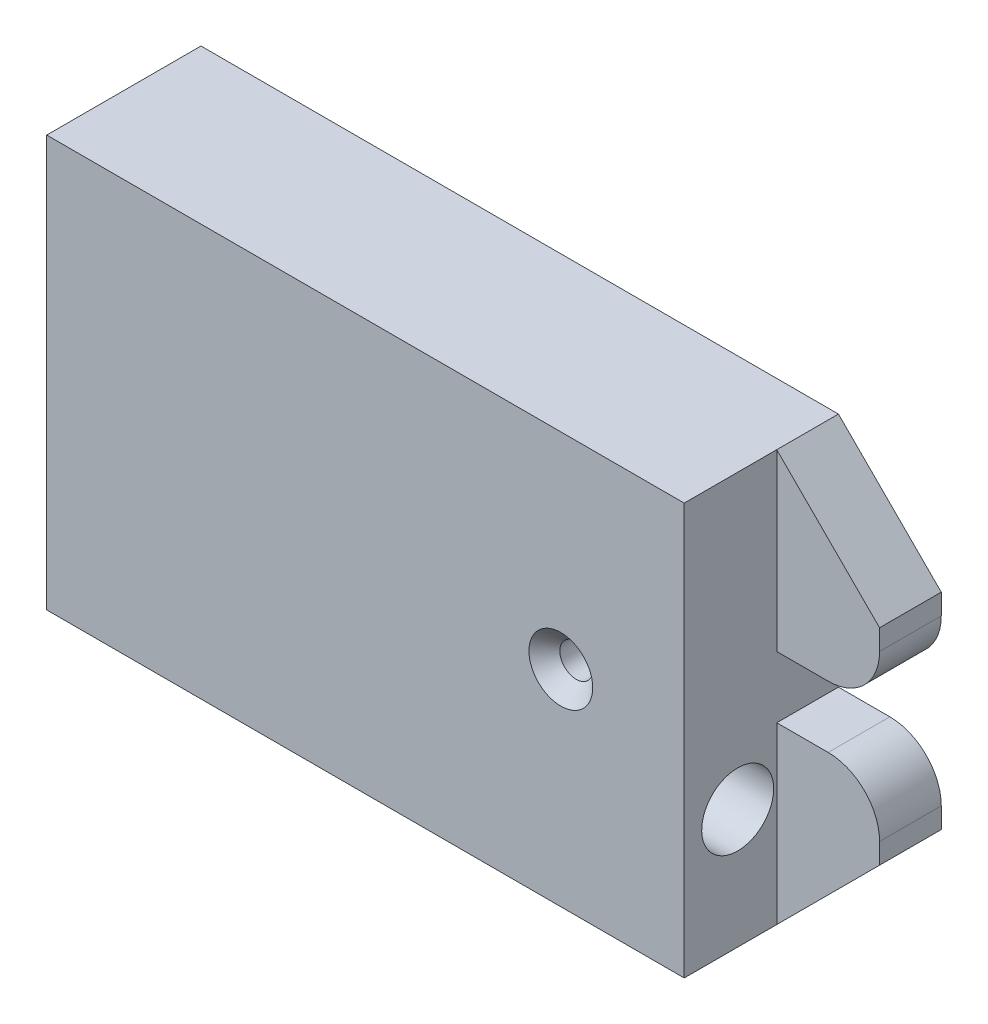
ISO-10303-21;
HEADER;
FILE_DESCRIPTION(('STEP AP214'),'2;1');
FILE_NAME('part.step','',(''),(''),'','','');
FILE_SCHEMA(('AUTOMOTIVE_DESIGN { 1 0 10303 214 1 1 1 1 }'));
ENDSEC;
DATA;
#1=APPLICATION_CONTEXT('core data for automotive mechanical design processes');
#2=APPLICATION_PROTOCOL_DEFINITION('international standard','automotive_design',2000,#1);
#3=PRODUCT_CONTEXT('',#1,'mechanical');
#4=PRODUCT('Part','Part','',(#3));
#5=PRODUCT_RELATED_PRODUCT_CATEGORY('part','',(#4));
#6=PRODUCT_DEFINITION_FORMATION('','',#4);
#7=PRODUCT_DEFINITION_CONTEXT('part definition',#1,'design');
#8=PRODUCT_DEFINITION('design','',#6,#7);
#9=PRODUCT_DEFINITION_SHAPE('','',#8);
#10=(LENGTH_UNIT() NAMED_UNIT(*) SI_UNIT(.MILLI.,.METRE.));
#11=(NAMED_UNIT(*) PLANE_ANGLE_UNIT() SI_UNIT($,.RADIAN.));
#12=(NAMED_UNIT(*) SI_UNIT($,.STERADIAN.) SOLID_ANGLE_UNIT());
#13=UNCERTAINTY_MEASURE_WITH_UNIT(LENGTH_MEASURE(1.E-05),#10,'distance_accuracy_value','');
#14=(GEOMETRIC_REPRESENTATION_CONTEXT(3) GLOBAL_UNCERTAINTY_ASSIGNED_CONTEXT((#13)) GLOBAL_UNIT_ASSIGNED_CONTEXT((#10,
#11,#12)) REPRESENTATION_CONTEXT('',''));
#15=CARTESIAN_POINT('',(0.,0.,0.));
#16=DIRECTION('',(0.,0.,1.));
#17=DIRECTION('',(1.,0.,0.));
#18=AXIS2_PLACEMENT_3D('',#15,#16,#17);
#19=CARTESIAN_POINT('',(41.000025,-8.8,9.8));
#20=DIRECTION('',(-1.,0.,0.));
#21=DIRECTION('',(0.,-1.,0.));
#22=AXIS2_PLACEMENT_3D('',#19,#20,#21);
#23=CYLINDRICAL_SURFACE('',#22,3.1);
#24=CARTESIAN_POINT('',(-31.,-8.80000000000001,9.8));
#25=DIRECTION('',(-1.,0.,0.));
#26=DIRECTION('',(0.,-1.,0.));
#27=AXIS2_PLACEMENT_3D('',#24,#25,#26);
#28=CIRCLE('',#27,3.1);
#29=CARTESIAN_POINT('',(-31.,-11.9,9.8));
#30=VERTEX_POINT('',#29);
#31=EDGE_CURVE('E153',#30,#30,#28,.T.);
#32=ORIENTED_EDGE('',*,*,#31,.T.);
#33=EDGE_LOOP('',(#32));
#34=FACE_BOUND('',#33,.T.);
#35=CARTESIAN_POINT('',(21.,-8.8,9.8));
#36=DIRECTION('',(1.,0.,0.));
#37=DIRECTION('',(0.,1.,0.));
#38=AXIS2_PLACEMENT_3D('',#35,#36,#37);
#39=CIRCLE('',#38,3.1);
#40=CARTESIAN_POINT('',(21.,-11.9,9.8));
#41=VERTEX_POINT('',#40);
#42=EDGE_CURVE('E11',#41,#41,#39,.F.);
#43=ORIENTED_EDGE('',*,*,#42,.F.);
#44=EDGE_LOOP('',(#43));
#45=FACE_BOUND('',#44,.T.);
#46=ADVANCED_FACE('F36',(#34,#45),#23,.F.);
#47=CARTESIAN_POINT('',(31.,20.,15.));
#48=DIRECTION('',(-1.,0.,0.));
#49=DIRECTION('',(0.,-1.,0.));
#50=AXIS2_PLACEMENT_3D('',#47,#48,#49);
#51=PLANE('',#50);
#52=CARTESIAN_POINT('',(31.,-8.4,9.8));
#53=DIRECTION('',(1.,0.,0.));
#54=DIRECTION('',(0.,1.,0.));
#55=AXIS2_PLACEMENT_3D('',#52,#53,#54);
#56=CIRCLE('',#55,3.5);
#57=CARTESIAN_POINT('',(31.,-4.9,9.8));
#58=VERTEX_POINT('',#57);
#59=EDGE_CURVE('E147',#58,#58,#56,.T.);
#60=ORIENTED_EDGE('',*,*,#59,.F.);
#61=EDGE_LOOP('',(#60));
#62=FACE_BOUND('',#61,.T.);
#63=DIRECTION('',(0.,1.,0.));
#64=VECTOR('',#63,1.);
#65=CARTESIAN_POINT('',(31.,0.,6.));
#66=LINE('',#65,#64);
#67=CARTESIAN_POINT('',(31.,-20.,6.));
#68=VERTEX_POINT('',#67);
#69=CARTESIAN_POINT('',(31.,-3.,6.));
#70=VERTEX_POINT('',#69);
#71=EDGE_CURVE('E169',#68,#70,#66,.T.);
#72=ORIENTED_EDGE('',*,*,#71,.T.);
#73=DIRECTION('',(0.,0.,-1.));
#74=VECTOR('',#73,1.);
#75=CARTESIAN_POINT('',(31.,-3.,6.));
#76=LINE('',#75,#74);
#77=CARTESIAN_POINT('',(31.,-3.,0.));
#78=VERTEX_POINT('',#77);
#79=EDGE_CURVE('E175',#70,#78,#76,.T.);
#80=ORIENTED_EDGE('',*,*,#79,.T.);
#81=DIRECTION('',(0.,1.,0.));
#82=VECTOR('',#81,1.);
#83=CARTESIAN_POINT('',(31.,20.,0.));
#84=LINE('',#83,#82);
#85=CARTESIAN_POINT('',(31.,3.,0.));
#86=VERTEX_POINT('',#85);
#87=EDGE_CURVE('E218',#78,#86,#84,.T.);
#88=ORIENTED_EDGE('',*,*,#87,.T.);
#89=DIRECTION('',(0.,0.,-1.));
#90=VECTOR('',#89,1.);
#91=CARTESIAN_POINT('',(31.,3.,6.));
#92=LINE('',#91,#90);
#93=CARTESIAN_POINT('',(31.,3.,6.));
#94=VERTEX_POINT('',#93);
#95=EDGE_CURVE('E209',#94,#86,#92,.T.);
#96=ORIENTED_EDGE('',*,*,#95,.F.);
#97=DIRECTION('',(0.,1.,0.));
#98=VECTOR('',#97,1.);
#99=CARTESIAN_POINT('',(31.,0.,6.));
#100=LINE('',#99,#98);
#101=CARTESIAN_POINT('',(31.,20.,6.));
#102=VERTEX_POINT('',#101);
#103=EDGE_CURVE('E194',#94,#102,#100,.T.);
#104=ORIENTED_EDGE('',*,*,#103,.T.);
#105=DIRECTION('',(0.,0.,-1.));
#106=VECTOR('',#105,1.);
#107=CARTESIAN_POINT('',(31.,20.,15.));
#108=LINE('',#107,#106);
#109=CARTESIAN_POINT('',(31.,20.,15.));
#110=VERTEX_POINT('',#109);
#111=EDGE_CURVE('E285',#110,#102,#108,.T.);
#112=ORIENTED_EDGE('',*,*,#111,.F.);
#113=DIRECTION('',(0.,1.,0.));
#114=VECTOR('',#113,1.);
#115=CARTESIAN_POINT('',(31.,20.,15.));
#116=LINE('',#115,#114);
#117=CARTESIAN_POINT('',(31.,-20.,15.));
#118=VERTEX_POINT('',#117);
#119=EDGE_CURVE('E278',#118,#110,#116,.T.);
#120=ORIENTED_EDGE('',*,*,#119,.F.);
#121=DIRECTION('',(0.,0.,-1.));
#122=VECTOR('',#121,1.);
#123=CARTESIAN_POINT('',(31.,-20.,15.));
#124=LINE('',#123,#122);
#125=EDGE_CURVE('E288',#118,#68,#124,.T.);
#126=ORIENTED_EDGE('',*,*,#125,.T.);
#127=EDGE_LOOP('',(#72,#80,#88,#96,#104,#112,#120,#126));
#128=FACE_BOUND('',#127,.T.);
#129=ADVANCED_FACE('F313',(#62,#128),#51,.F.);
#130=CARTESIAN_POINT('',(-31.,-20.,15.));
#131=DIRECTION('',(0.,0.,1.));
#132=DIRECTION('',(1.,0.,0.));
#133=AXIS2_PLACEMENT_3D('',#130,#131,#132);
#134=PLANE('',#133);
#135=CARTESIAN_POINT('',(19.,0.,15.));
#136=DIRECTION('',(0.,0.,1.));
#137=DIRECTION('',(1.,0.,0.));
#138=AXIS2_PLACEMENT_3D('',#135,#136,#137);
#139=CIRCLE('',#138,3.09999999999999);
#140=CARTESIAN_POINT('',(22.1,0.,15.));
#141=VERTEX_POINT('',#140);
#142=EDGE_CURVE('E44',#141,#141,#139,.F.);
#143=ORIENTED_EDGE('',*,*,#142,.T.);
#144=EDGE_LOOP('',(#143));
#145=FACE_BOUND('',#144,.T.);
#146=DIRECTION('',(0.,-1.,0.));
#147=VECTOR('',#146,1.);
#148=CARTESIAN_POINT('',(-31.,20.,15.));
#149=LINE('',#148,#147);
#150=CARTESIAN_POINT('',(-31.,20.,15.));
#151=VERTEX_POINT('',#150);
#152=CARTESIAN_POINT('',(-31.,-20.,15.));
#153=VERTEX_POINT('',#152);
#154=EDGE_CURVE('E273',#151,#153,#149,.T.);
#155=ORIENTED_EDGE('',*,*,#154,.T.);
#156=DIRECTION('',(1.,0.,0.));
#157=VECTOR('',#156,1.);
#158=CARTESIAN_POINT('',(-31.,-20.,15.));
#159=LINE('',#158,#157);
#160=EDGE_CURVE('E276',#153,#118,#159,.T.);
#161=ORIENTED_EDGE('',*,*,#160,.T.);
#162=ORIENTED_EDGE('',*,*,#119,.T.);
#163=DIRECTION('',(-1.,0.,0.));
#164=VECTOR('',#163,1.);
#165=CARTESIAN_POINT('',(-31.,20.,15.));
#166=LINE('',#165,#164);
#167=EDGE_CURVE('E280',#110,#151,#166,.T.);
#168=ORIENTED_EDGE('',*,*,#167,.T.);
#169=EDGE_LOOP('',(#155,#161,#162,#168));
#170=FACE_BOUND('',#169,.T.);
#171=ADVANCED_FACE('F243',(#145,#170),#134,.T.);
#172=CARTESIAN_POINT('',(-31.,-20.,0.));
#173=DIRECTION('',(0.,0.,1.));
#174=DIRECTION('',(1.,0.,0.));
#175=AXIS2_PLACEMENT_3D('',#172,#173,#174);
#176=PLANE('',#175);
#177=DIRECTION('',(1.,0.,0.));
#178=VECTOR('',#177,1.);
#179=CARTESIAN_POINT('',(-59.2063883819059,-3.,0.));
#180=LINE('',#179,#178);
#181=CARTESIAN_POINT('',(36.,-3.,0.));
#182=VERTEX_POINT('',#181);
#183=EDGE_CURVE('E161',#78,#182,#180,.T.);
#184=ORIENTED_EDGE('',*,*,#183,.T.);
#185=CARTESIAN_POINT('',(36.,-8.,0.));
#186=DIRECTION('',(0.,0.,1.));
#187=DIRECTION('',(1.,0.,0.));
#188=AXIS2_PLACEMENT_3D('',#185,#186,#187);
#189=CIRCLE('',#188,5.);
#190=CARTESIAN_POINT('',(41.,-8.,0.));
#191=VERTEX_POINT('',#190);
#192=EDGE_CURVE('E226',#182,#191,#189,.F.);
#193=ORIENTED_EDGE('',*,*,#192,.T.);
#194=DIRECTION('',(0.,-1.,0.));
#195=VECTOR('',#194,1.);
#196=CARTESIAN_POINT('',(41.,0.,0.));
#197=LINE('',#196,#195);
#198=CARTESIAN_POINT('',(41.,-9.99999999999999,0.));
#199=VERTEX_POINT('',#198);
#200=EDGE_CURVE('E156',#191,#199,#197,.T.);
#201=ORIENTED_EDGE('',*,*,#200,.T.);
#202=DIRECTION('',(-0.707106781186547,-0.707106781186548,0.));
#203=VECTOR('',#202,1.);
#204=CARTESIAN_POINT('',(-4.10319419095287,-55.1031941909529,0.));
#205=LINE('',#204,#203);
#206=CARTESIAN_POINT('',(31.,-20.,0.));
#207=VERTEX_POINT('',#206);
#208=EDGE_CURVE('E158',#199,#207,#205,.T.);
#209=ORIENTED_EDGE('',*,*,#208,.T.);
#210=DIRECTION('',(1.,0.,0.));
#211=VECTOR('',#210,1.);
#212=CARTESIAN_POINT('',(-31.,-20.,0.));
#213=LINE('',#212,#211);
#214=CARTESIAN_POINT('',(-31.,-20.,0.));
#215=VERTEX_POINT('',#214);
#216=EDGE_CURVE('E266',#215,#207,#213,.T.);
#217=ORIENTED_EDGE('',*,*,#216,.F.);
#218=DIRECTION('',(0.,-1.,0.));
#219=VECTOR('',#218,1.);
#220=CARTESIAN_POINT('',(-31.,20.,0.));
#221=LINE('',#220,#219);
#222=CARTESIAN_POINT('',(-31.,20.,0.));
#223=VERTEX_POINT('',#222);
#224=EDGE_CURVE('E264',#223,#215,#221,.T.);
#225=ORIENTED_EDGE('',*,*,#224,.F.);
#226=DIRECTION('',(-1.,0.,0.));
#227=VECTOR('',#226,1.);
#228=CARTESIAN_POINT('',(-31.,20.,0.));
#229=LINE('',#228,#227);
#230=CARTESIAN_POINT('',(31.,20.,0.));
#231=VERTEX_POINT('',#230);
#232=EDGE_CURVE('E271',#231,#223,#229,.T.);
#233=ORIENTED_EDGE('',*,*,#232,.F.);
#234=DIRECTION('',(0.707106781186548,-0.707106781186547,0.));
#235=VECTOR('',#234,1.);
#236=CARTESIAN_POINT('',(-4.10319419095295,55.1031941909529,0.));
#237=LINE('',#236,#235);
#238=CARTESIAN_POINT('',(41.,10.,0.));
#239=VERTEX_POINT('',#238);
#240=EDGE_CURVE('E186',#231,#239,#237,.T.);
#241=ORIENTED_EDGE('',*,*,#240,.T.);
#242=DIRECTION('',(0.,-1.,0.));
#243=VECTOR('',#242,1.);
#244=CARTESIAN_POINT('',(41.,0.,0.));
#245=LINE('',#244,#243);
#246=CARTESIAN_POINT('',(41.,8.,0.));
#247=VERTEX_POINT('',#246);
#248=EDGE_CURVE('E177',#239,#247,#245,.T.);
#249=ORIENTED_EDGE('',*,*,#248,.T.);
#250=CARTESIAN_POINT('',(36.,8.,0.));
#251=DIRECTION('',(0.,0.,1.));
#252=DIRECTION('',(1.,0.,0.));
#253=AXIS2_PLACEMENT_3D('',#250,#251,#252);
#254=CIRCLE('',#253,5.);
#255=CARTESIAN_POINT('',(36.,3.,0.));
#256=VERTEX_POINT('',#255);
#257=EDGE_CURVE('E224',#247,#256,#254,.F.);
#258=ORIENTED_EDGE('',*,*,#257,.T.);
#259=DIRECTION('',(-1.,0.,0.));
#260=VECTOR('',#259,1.);
#261=CARTESIAN_POINT('',(-59.2063883819059,2.99999999999999,0.));
#262=LINE('',#261,#260);
#263=EDGE_CURVE('E185',#256,#86,#262,.T.);
#264=ORIENTED_EDGE('',*,*,#263,.T.);
#265=ORIENTED_EDGE('',*,*,#87,.F.);
#266=EDGE_LOOP('',(#184,#193,#201,#209,#217,#225,#233,#241,#249,#258,#264,#265));
#267=FACE_BOUND('',#266,.T.);
#268=CARTESIAN_POINT('',(19.,0.,0.));
#269=DIRECTION('',(0.,0.,1.));
#270=DIRECTION('',(1.,0.,0.));
#271=AXIS2_PLACEMENT_3D('',#268,#269,#270);
#272=CIRCLE('',#271,1.6);
#273=CARTESIAN_POINT('',(20.6,0.,0.));
#274=VERTEX_POINT('',#273);
#275=EDGE_CURVE('E262',#274,#274,#272,.T.);
#276=ORIENTED_EDGE('',*,*,#275,.T.);
#277=EDGE_LOOP('',(#276));
#278=FACE_BOUND('',#277,.T.);
#279=ADVANCED_FACE('F308',(#267,#278),#176,.F.);
#280=CARTESIAN_POINT('',(-31.,20.,15.));
#281=DIRECTION('',(1.,0.,0.));
#282=DIRECTION('',(0.,1.,0.));
#283=AXIS2_PLACEMENT_3D('',#280,#281,#282);
#284=PLANE('',#283);
#285=CARTESIAN_POINT('',(-31.,6.19999999999999,7.5));
#286=DIRECTION('',(-1.,0.,0.));
#287=DIRECTION('',(0.,0.,1.));
#288=AXIS2_PLACEMENT_3D('',#285,#286,#287);
#289=CIRCLE('',#288,2.1);
#290=CARTESIAN_POINT('',(-31.,6.19999999999999,9.6));
#291=VERTEX_POINT('',#290);
#292=EDGE_CURVE('E144',#291,#291,#289,.T.);
#293=ORIENTED_EDGE('',*,*,#292,.F.);
#294=EDGE_LOOP('',(#293));
#295=FACE_BOUND('',#294,.T.);
#296=ORIENTED_EDGE('',*,*,#31,.F.);
#297=EDGE_LOOP('',(#296));
#298=FACE_BOUND('',#297,.T.);
#299=ORIENTED_EDGE('',*,*,#224,.T.);
#300=DIRECTION('',(0.,0.,-1.));
#301=VECTOR('',#300,1.);
#302=CARTESIAN_POINT('',(-31.,-20.,15.));
#303=LINE('',#302,#301);
#304=EDGE_CURVE('E292',#153,#215,#303,.T.);
#305=ORIENTED_EDGE('',*,*,#304,.F.);
#306=ORIENTED_EDGE('',*,*,#154,.F.);
#307=DIRECTION('',(0.,0.,-1.));
#308=VECTOR('',#307,1.);
#309=CARTESIAN_POINT('',(-31.,20.,15.));
#310=LINE('',#309,#308);
#311=EDGE_CURVE('E282',#151,#223,#310,.T.);
#312=ORIENTED_EDGE('',*,*,#311,.T.);
#313=EDGE_LOOP('',(#299,#305,#306,#312));
#314=FACE_BOUND('',#313,.T.);
#315=ADVANCED_FACE('F38',(#295,#298,#314),#284,.F.);
#316=CARTESIAN_POINT('',(-31.,-20.,15.));
#317=DIRECTION('',(0.,1.,0.));
#318=DIRECTION('',(-1.,0.,0.));
#319=AXIS2_PLACEMENT_3D('',#316,#317,#318);
#320=PLANE('',#319);
#321=ORIENTED_EDGE('',*,*,#216,.T.);
#322=DIRECTION('',(0.,0.,-1.));
#323=VECTOR('',#322,1.);
#324=CARTESIAN_POINT('',(31.,-20.,6.));
#325=LINE('',#324,#323);
#326=EDGE_CURVE('E178',#68,#207,#325,.T.);
#327=ORIENTED_EDGE('',*,*,#326,.F.);
#328=ORIENTED_EDGE('',*,*,#125,.F.);
#329=ORIENTED_EDGE('',*,*,#160,.F.);
#330=ORIENTED_EDGE('',*,*,#304,.T.);
#331=EDGE_LOOP('',(#321,#327,#328,#329,#330));
#332=FACE_BOUND('',#331,.T.);
#333=ADVANCED_FACE('F346',(#332),#320,.F.);
#334=CARTESIAN_POINT('',(-31.,20.,15.));
#335=DIRECTION('',(0.,-1.,0.));
#336=DIRECTION('',(1.,0.,0.));
#337=AXIS2_PLACEMENT_3D('',#334,#335,#336);
#338=PLANE('',#337);
#339=ORIENTED_EDGE('',*,*,#232,.T.);
#340=ORIENTED_EDGE('',*,*,#311,.F.);
#341=ORIENTED_EDGE('',*,*,#167,.F.);
#342=ORIENTED_EDGE('',*,*,#111,.T.);
#343=DIRECTION('',(0.,0.,-1.));
#344=VECTOR('',#343,1.);
#345=CARTESIAN_POINT('',(31.,20.,6.));
#346=LINE('',#345,#344);
#347=EDGE_CURVE('E206',#102,#231,#346,.T.);
#348=ORIENTED_EDGE('',*,*,#347,.T.);
#349=EDGE_LOOP('',(#339,#340,#341,#342,#348));
#350=FACE_BOUND('',#349,.T.);
#351=ADVANCED_FACE('F258',(#350),#338,.F.);
#352=CARTESIAN_POINT('',(19.,0.,15.));
#353=DIRECTION('',(0.,0.,-1.));
#354=DIRECTION('',(-1.,0.,0.));
#355=AXIS2_PLACEMENT_3D('',#352,#353,#354);
#356=CYLINDRICAL_SURFACE('',#355,1.6);
#357=CARTESIAN_POINT('',(19.,0.,13.5));
#358=DIRECTION('',(0.,0.,1.));
#359=DIRECTION('',(1.,0.,0.));
#360=AXIS2_PLACEMENT_3D('',#357,#358,#359);
#361=CIRCLE('',#360,1.6);
#362=CARTESIAN_POINT('',(20.6,0.,13.5));
#363=VERTEX_POINT('',#362);
#364=EDGE_CURVE('E238',#363,#363,#361,.T.);
#365=ORIENTED_EDGE('',*,*,#364,.T.);
#366=EDGE_LOOP('',(#365));
#367=FACE_BOUND('',#366,.T.);
#368=ORIENTED_EDGE('',*,*,#275,.F.);
#369=EDGE_LOOP('',(#368));
#370=FACE_BOUND('',#369,.T.);
#371=ADVANCED_FACE('F254',(#367,#370),#356,.F.);
#372=CARTESIAN_POINT('',(41.,0.,6.));
#373=DIRECTION('',(1.,0.,0.));
#374=DIRECTION('',(0.,0.,-1.));
#375=AXIS2_PLACEMENT_3D('',#372,#373,#374);
#376=PLANE('',#375);
#377=DIRECTION('',(0.,-1.,0.));
#378=VECTOR('',#377,1.);
#379=CARTESIAN_POINT('',(41.,0.,6.));
#380=LINE('',#379,#378);
#381=CARTESIAN_POINT('',(41.,10.,6.));
#382=VERTEX_POINT('',#381);
#383=CARTESIAN_POINT('',(41.,8.,6.));
#384=VERTEX_POINT('',#383);
#385=EDGE_CURVE('E189',#382,#384,#380,.T.);
#386=ORIENTED_EDGE('',*,*,#385,.T.);
#387=DIRECTION('',(0.,0.,-1.));
#388=VECTOR('',#387,1.);
#389=CARTESIAN_POINT('',(41.,8.,6.));
#390=LINE('',#389,#388);
#391=EDGE_CURVE('E232',#384,#247,#390,.T.);
#392=ORIENTED_EDGE('',*,*,#391,.T.);
#393=ORIENTED_EDGE('',*,*,#248,.F.);
#394=DIRECTION('',(0.,0.,-1.));
#395=VECTOR('',#394,1.);
#396=CARTESIAN_POINT('',(41.,10.,6.));
#397=LINE('',#396,#395);
#398=EDGE_CURVE('E197',#382,#239,#397,.T.);
#399=ORIENTED_EDGE('',*,*,#398,.F.);
#400=EDGE_LOOP('',(#386,#392,#393,#399));
#401=FACE_BOUND('',#400,.T.);
#402=ADVANCED_FACE('F257',(#401),#376,.T.);
#403=CARTESIAN_POINT('',(-4.10319419095295,55.1031941909529,6.));
#404=DIRECTION('',(0.707106781186547,0.707106781186548,0.));
#405=DIRECTION('',(-0.707106781186548,0.707106781186547,0.));
#406=AXIS2_PLACEMENT_3D('',#403,#404,#405);
#407=PLANE('',#406);
#408=ORIENTED_EDGE('',*,*,#240,.F.);
#409=ORIENTED_EDGE('',*,*,#347,.F.);
#410=DIRECTION('',(0.707106781186548,-0.707106781186547,0.));
#411=VECTOR('',#410,1.);
#412=CARTESIAN_POINT('',(-4.10319419095295,55.1031941909529,6.));
#413=LINE('',#412,#411);
#414=EDGE_CURVE('E203',#102,#382,#413,.T.);
#415=ORIENTED_EDGE('',*,*,#414,.T.);
#416=ORIENTED_EDGE('',*,*,#398,.T.);
#417=EDGE_LOOP('',(#408,#409,#415,#416));
#418=FACE_BOUND('',#417,.T.);
#419=ADVANCED_FACE('F296',(#418),#407,.T.);
#420=CARTESIAN_POINT('',(-59.2063883819059,2.99999999999999,6.));
#421=DIRECTION('',(0.,-1.,0.));
#422=DIRECTION('',(1.,0.,0.));
#423=AXIS2_PLACEMENT_3D('',#420,#421,#422);
#424=PLANE('',#423);
#425=ORIENTED_EDGE('',*,*,#263,.F.);
#426=DIRECTION('',(0.,0.,-1.));
#427=VECTOR('',#426,1.);
#428=CARTESIAN_POINT('',(36.,3.,6.));
#429=LINE('',#428,#427);
#430=CARTESIAN_POINT('',(36.,3.,6.));
#431=VERTEX_POINT('',#430);
#432=EDGE_CURVE('E56',#256,#431,#429,.F.);
#433=ORIENTED_EDGE('',*,*,#432,.T.);
#434=DIRECTION('',(-1.,0.,0.));
#435=VECTOR('',#434,1.);
#436=CARTESIAN_POINT('',(-59.2063883819059,2.99999999999999,6.));
#437=LINE('',#436,#435);
#438=EDGE_CURVE('E192',#431,#94,#437,.T.);
#439=ORIENTED_EDGE('',*,*,#438,.T.);
#440=ORIENTED_EDGE('',*,*,#95,.T.);
#441=EDGE_LOOP('',(#425,#433,#439,#440));
#442=FACE_BOUND('',#441,.T.);
#443=ADVANCED_FACE('F311',(#442),#424,.T.);
#444=CARTESIAN_POINT('',(-59.2063883819059,0.,6.));
#445=DIRECTION('',(0.,0.,-1.));
#446=DIRECTION('',(-1.,0.,0.));
#447=AXIS2_PLACEMENT_3D('',#444,#445,#446);
#448=PLANE('',#447);
#449=ORIENTED_EDGE('',*,*,#438,.F.);
#450=CARTESIAN_POINT('',(36.,8.,6.));
#451=DIRECTION('',(0.,0.,-1.));
#452=DIRECTION('',(-1.,0.,0.));
#453=AXIS2_PLACEMENT_3D('',#450,#451,#452);
#454=CIRCLE('',#453,5.);
#455=EDGE_CURVE('E236',#431,#384,#454,.F.);
#456=ORIENTED_EDGE('',*,*,#455,.T.);
#457=ORIENTED_EDGE('',*,*,#385,.F.);
#458=ORIENTED_EDGE('',*,*,#414,.F.);
#459=ORIENTED_EDGE('',*,*,#103,.F.);
#460=EDGE_LOOP('',(#449,#456,#457,#458,#459));
#461=FACE_BOUND('',#460,.T.);
#462=ADVANCED_FACE('F301',(#461),#448,.F.);
#463=CARTESIAN_POINT('',(41.,0.,6.));
#464=DIRECTION('',(1.,0.,0.));
#465=DIRECTION('',(0.,1.,0.));
#466=AXIS2_PLACEMENT_3D('',#463,#464,#465);
#467=PLANE('',#466);
#468=ORIENTED_EDGE('',*,*,#200,.F.);
#469=DIRECTION('',(0.,0.,-1.));
#470=VECTOR('',#469,1.);
#471=CARTESIAN_POINT('',(41.,-8.,6.));
#472=LINE('',#471,#470);
#473=CARTESIAN_POINT('',(41.,-8.,6.));
#474=VERTEX_POINT('',#473);
#475=EDGE_CURVE('E228',#191,#474,#472,.F.);
#476=ORIENTED_EDGE('',*,*,#475,.T.);
#477=DIRECTION('',(0.,-1.,0.));
#478=VECTOR('',#477,1.);
#479=CARTESIAN_POINT('',(41.,0.,6.));
#480=LINE('',#479,#478);
#481=CARTESIAN_POINT('',(41.,-9.99999999999999,6.));
#482=VERTEX_POINT('',#481);
#483=EDGE_CURVE('E164',#474,#482,#480,.T.);
#484=ORIENTED_EDGE('',*,*,#483,.T.);
#485=DIRECTION('',(0.,0.,-1.));
#486=VECTOR('',#485,1.);
#487=CARTESIAN_POINT('',(41.,-9.99999999999999,6.));
#488=LINE('',#487,#486);
#489=EDGE_CURVE('E174',#482,#199,#488,.T.);
#490=ORIENTED_EDGE('',*,*,#489,.T.);
#491=EDGE_LOOP('',(#468,#476,#484,#490));
#492=FACE_BOUND('',#491,.T.);
#493=ADVANCED_FACE('F341',(#492),#467,.T.);
#494=CARTESIAN_POINT('',(-59.2063883819059,-3.,6.));
#495=DIRECTION('',(0.,1.,0.));
#496=DIRECTION('',(0.,0.,1.));
#497=AXIS2_PLACEMENT_3D('',#494,#495,#496);
#498=PLANE('',#497);
#499=DIRECTION('',(1.,0.,0.));
#500=VECTOR('',#499,1.);
#501=CARTESIAN_POINT('',(-59.2063883819059,-3.,6.));
#502=LINE('',#501,#500);
#503=CARTESIAN_POINT('',(36.,-3.,6.));
#504=VERTEX_POINT('',#503);
#505=EDGE_CURVE('E171',#70,#504,#502,.T.);
#506=ORIENTED_EDGE('',*,*,#505,.T.);
#507=DIRECTION('',(0.,0.,-1.));
#508=VECTOR('',#507,1.);
#509=CARTESIAN_POINT('',(36.,-3.,6.));
#510=LINE('',#509,#508);
#511=EDGE_CURVE('E223',#504,#182,#510,.T.);
#512=ORIENTED_EDGE('',*,*,#511,.T.);
#513=ORIENTED_EDGE('',*,*,#183,.F.);
#514=ORIENTED_EDGE('',*,*,#79,.F.);
#515=EDGE_LOOP('',(#506,#512,#513,#514));
#516=FACE_BOUND('',#515,.T.);
#517=ADVANCED_FACE('F319',(#516),#498,.T.);
#518=CARTESIAN_POINT('',(-4.10319419095287,-55.1031941909529,6.));
#519=DIRECTION('',(0.707106781186548,-0.707106781186547,0.));
#520=DIRECTION('',(0.707106781186547,0.707106781186548,0.));
#521=AXIS2_PLACEMENT_3D('',#518,#519,#520);
#522=PLANE('',#521);
#523=ORIENTED_EDGE('',*,*,#208,.F.);
#524=ORIENTED_EDGE('',*,*,#489,.F.);
#525=DIRECTION('',(-0.707106781186547,-0.707106781186548,0.));
#526=VECTOR('',#525,1.);
#527=CARTESIAN_POINT('',(-4.10319419095287,-55.1031941909529,6.));
#528=LINE('',#527,#526);
#529=EDGE_CURVE('E166',#482,#68,#528,.T.);
#530=ORIENTED_EDGE('',*,*,#529,.T.);
#531=ORIENTED_EDGE('',*,*,#326,.T.);
#532=EDGE_LOOP('',(#523,#524,#530,#531));
#533=FACE_BOUND('',#532,.T.);
#534=ADVANCED_FACE('F338',(#533),#522,.T.);
#535=CARTESIAN_POINT('',(-59.2063883819059,0.,6.));
#536=DIRECTION('',(0.,0.,-1.));
#537=DIRECTION('',(-1.,0.,0.));
#538=AXIS2_PLACEMENT_3D('',#535,#536,#537);
#539=PLANE('',#538);
#540=ORIENTED_EDGE('',*,*,#483,.F.);
#541=CARTESIAN_POINT('',(36.,-8.,6.));
#542=DIRECTION('',(0.,0.,-1.));
#543=DIRECTION('',(-1.,0.,0.));
#544=AXIS2_PLACEMENT_3D('',#541,#542,#543);
#545=CIRCLE('',#544,5.);
#546=EDGE_CURVE('E230',#474,#504,#545,.F.);
#547=ORIENTED_EDGE('',*,*,#546,.T.);
#548=ORIENTED_EDGE('',*,*,#505,.F.);
#549=ORIENTED_EDGE('',*,*,#71,.F.);
#550=ORIENTED_EDGE('',*,*,#529,.F.);
#551=EDGE_LOOP('',(#540,#547,#548,#549,#550));
#552=FACE_BOUND('',#551,.T.);
#553=ADVANCED_FACE('F334',(#552),#539,.F.);
#554=CARTESIAN_POINT('',(36.,-8.,6.));
#555=DIRECTION('',(0.,0.,-1.));
#556=DIRECTION('',(-1.,0.,0.));
#557=AXIS2_PLACEMENT_3D('',#554,#555,#556);
#558=CYLINDRICAL_SURFACE('',#557,5.);
#559=ORIENTED_EDGE('',*,*,#546,.F.);
#560=ORIENTED_EDGE('',*,*,#475,.F.);
#561=ORIENTED_EDGE('',*,*,#192,.F.);
#562=ORIENTED_EDGE('',*,*,#511,.F.);
#563=EDGE_LOOP('',(#559,#560,#561,#562));
#564=FACE_BOUND('',#563,.T.);
#565=ADVANCED_FACE('F343',(#564),#558,.T.);
#566=CARTESIAN_POINT('',(36.,8.,6.));
#567=DIRECTION('',(0.,0.,-1.));
#568=DIRECTION('',(-1.,0.,0.));
#569=AXIS2_PLACEMENT_3D('',#566,#567,#568);
#570=CYLINDRICAL_SURFACE('',#569,5.);
#571=ORIENTED_EDGE('',*,*,#455,.F.);
#572=ORIENTED_EDGE('',*,*,#432,.F.);
#573=ORIENTED_EDGE('',*,*,#257,.F.);
#574=ORIENTED_EDGE('',*,*,#391,.F.);
#575=EDGE_LOOP('',(#571,#572,#573,#574));
#576=FACE_BOUND('',#575,.T.);
#577=ADVANCED_FACE('F250',(#576),#570,.T.);
#578=CARTESIAN_POINT('',(19.,0.,13.5));
#579=DIRECTION('',(0.,0.,1.));
#580=DIRECTION('',(1.,0.,0.));
#581=AXIS2_PLACEMENT_3D('',#578,#579,#580);
#582=CONICAL_SURFACE('',#581,1.6,0.785398163397449);
#583=ORIENTED_EDGE('',*,*,#142,.F.);
#584=EDGE_LOOP('',(#583));
#585=FACE_BOUND('',#584,.T.);
#586=ORIENTED_EDGE('',*,*,#364,.F.);
#587=EDGE_LOOP('',(#586));
#588=FACE_BOUND('',#587,.T.);
#589=ADVANCED_FACE('F246',(#585,#588),#582,.F.);
#590=CARTESIAN_POINT('',(21.,-8.4,9.8));
#591=DIRECTION('',(1.,0.,0.));
#592=DIRECTION('',(0.,1.,0.));
#593=AXIS2_PLACEMENT_3D('',#590,#591,#592);
#594=PLANE('',#593);
#595=CARTESIAN_POINT('',(21.,-8.4,9.8));
#596=DIRECTION('',(1.,0.,0.));
#597=DIRECTION('',(0.,1.,0.));
#598=AXIS2_PLACEMENT_3D('',#595,#596,#597);
#599=CIRCLE('',#598,3.5);
#600=EDGE_CURVE('E49',#41,#41,#599,.T.);
#601=ORIENTED_EDGE('',*,*,#600,.T.);
#602=ORIENTED_EDGE('',*,*,#42,.T.);
#603=EDGE_LOOP('',(#601,#602));
#604=FACE_BOUND('',#603,.T.);
#605=ADVANCED_FACE('F249',(#604),#594,.T.);
#606=CARTESIAN_POINT('',(21.,-8.4,9.8));
#607=DIRECTION('',(1.,0.,0.));
#608=DIRECTION('',(0.,1.,0.));
#609=AXIS2_PLACEMENT_3D('',#606,#607,#608);
#610=CYLINDRICAL_SURFACE('',#609,3.5);
#611=ORIENTED_EDGE('',*,*,#59,.T.);
#612=EDGE_LOOP('',(#611));
#613=FACE_BOUND('',#612,.T.);
#614=ORIENTED_EDGE('',*,*,#600,.F.);
#615=EDGE_LOOP('',(#614));
#616=FACE_BOUND('',#615,.T.);
#617=ADVANCED_FACE('F365',(#613,#616),#610,.F.);
#618=CARTESIAN_POINT('',(-31.,6.19999999999999,7.5));
#619=DIRECTION('',(-1.,0.,0.));
#620=DIRECTION('',(0.,0.,1.));
#621=AXIS2_PLACEMENT_3D('',#618,#619,#620);
#622=CYLINDRICAL_SURFACE('',#621,2.1);
#623=CARTESIAN_POINT('',(-9.,6.19999999999999,7.5));
#624=DIRECTION('',(-1.,0.,0.));
#625=DIRECTION('',(0.,0.,1.));
#626=AXIS2_PLACEMENT_3D('',#623,#624,#625);
#627=CIRCLE('',#626,2.09999999999999);
#628=CARTESIAN_POINT('',(-9.,6.19999999999999,9.59999999999999));
#629=VERTEX_POINT('',#628);
#630=EDGE_CURVE('E142',#629,#629,#627,.T.);
#631=ORIENTED_EDGE('',*,*,#630,.F.);
#632=EDGE_LOOP('',(#631));
#633=FACE_BOUND('',#632,.T.);
#634=ORIENTED_EDGE('',*,*,#292,.T.);
#635=EDGE_LOOP('',(#634));
#636=FACE_BOUND('',#635,.T.);
#637=ADVANCED_FACE('F138',(#633,#636),#622,.F.);
#638=CARTESIAN_POINT('',(-9.,6.19999999999999,7.5));
#639=DIRECTION('',(-1.,0.,0.));
#640=DIRECTION('',(0.,0.,1.));
#641=AXIS2_PLACEMENT_3D('',#638,#639,#640);
#642=CONICAL_SURFACE('',#641,2.09999999999999,1.02974425867665);
#643=CARTESIAN_POINT('',(-7.73819270004212,6.19999999999998,7.5));
#644=VERTEX_POINT('',#643);
#645=VERTEX_LOOP('',#644);
#646=FACE_BOUND('',#645,.T.);
#647=ORIENTED_EDGE('',*,*,#630,.T.);
#648=EDGE_LOOP('',(#647));
#649=FACE_BOUND('',#648,.T.);
#650=ADVANCED_FACE('F135',(#646,#649),#642,.F.);
#651=CLOSED_SHELL('',(#46,#129,#171,#279,#315,#333,#351,#371,#402,#419,#443,#462,#493,#517,#534,
#553,#565,#577,#589,#605,#617,#637,#650));
#652=MANIFOLD_SOLID_BREP('B2',#651);
#653=ADVANCED_BREP_SHAPE_REPRESENTATION('',(#18,#652),#14);
#654=SHAPE_DEFINITION_REPRESENTATION(#9,#653);
ENDSEC;
END-ISO-10303-21;
